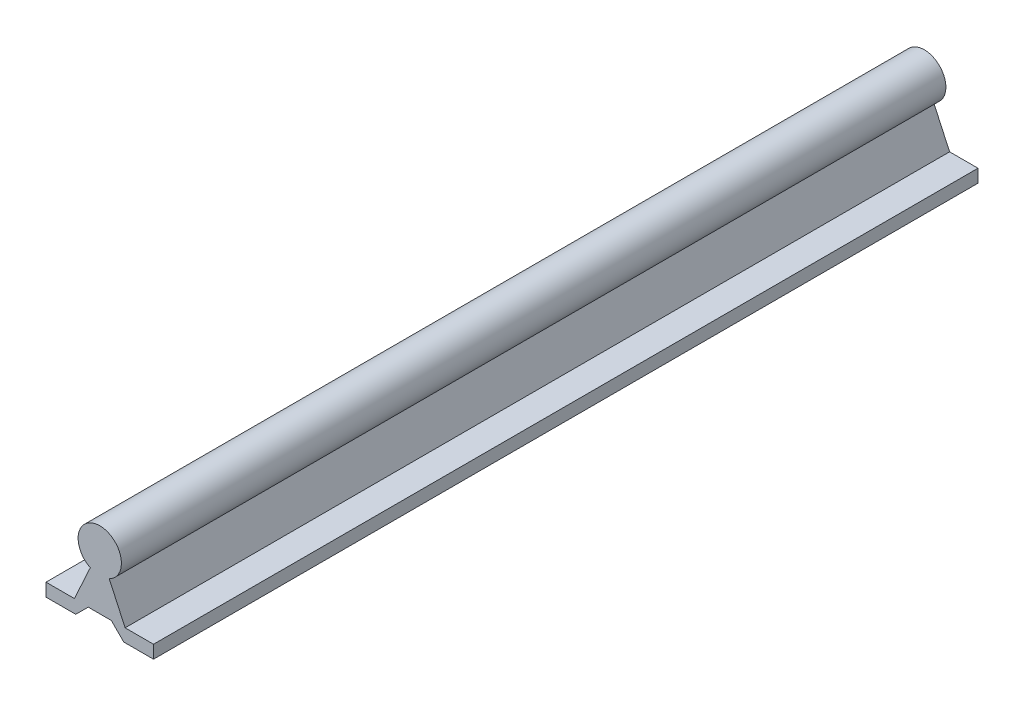
ISO-10303-21;
HEADER;
FILE_DESCRIPTION(('STEP AP214'),'2;1');
FILE_NAME('part.step','',(''),(''),'','','');
FILE_SCHEMA(('AUTOMOTIVE_DESIGN { 1 0 10303 214 1 1 1 1 }'));
ENDSEC;
DATA;
#1=APPLICATION_CONTEXT('core data for automotive mechanical design processes');
#2=APPLICATION_PROTOCOL_DEFINITION('international standard','automotive_design',2000,#1);
#3=PRODUCT_CONTEXT('',#1,'mechanical');
#4=PRODUCT('Part','Part','',(#3));
#5=PRODUCT_RELATED_PRODUCT_CATEGORY('part','',(#4));
#6=PRODUCT_DEFINITION_FORMATION('','',#4);
#7=PRODUCT_DEFINITION_CONTEXT('part definition',#1,'design');
#8=PRODUCT_DEFINITION('design','',#6,#7);
#9=PRODUCT_DEFINITION_SHAPE('','',#8);
#10=(LENGTH_UNIT() NAMED_UNIT(*) SI_UNIT(.MILLI.,.METRE.));
#11=(NAMED_UNIT(*) PLANE_ANGLE_UNIT() SI_UNIT($,.RADIAN.));
#12=(NAMED_UNIT(*) SI_UNIT($,.STERADIAN.) SOLID_ANGLE_UNIT());
#13=UNCERTAINTY_MEASURE_WITH_UNIT(LENGTH_MEASURE(1.E-05),#10,'distance_accuracy_value','');
#14=(GEOMETRIC_REPRESENTATION_CONTEXT(3) GLOBAL_UNCERTAINTY_ASSIGNED_CONTEXT((#13)) GLOBAL_UNIT_ASSIGNED_CONTEXT((#10,
#11,#12)) REPRESENTATION_CONTEXT('',''));
#15=CARTESIAN_POINT('',(0.,0.,0.));
#16=DIRECTION('',(0.,0.,1.));
#17=DIRECTION('',(1.,0.,0.));
#18=AXIS2_PLACEMENT_3D('',#15,#16,#17);
#19=CARTESIAN_POINT('',(9.5641655714519,4.38765921480913,304.8));
#20=DIRECTION('',(0.908917784747808,0.416975371657772,0.));
#21=DIRECTION('',(-0.416975371657772,0.908917784747808,0.));
#22=AXIS2_PLACEMENT_3D('',#19,#20,#21);
#23=PLANE('',#22);
#24=DIRECTION('',(0.416975371657772,-0.908917784747808,0.));
#25=VECTOR('',#24,1.);
#26=CARTESIAN_POINT('',(9.5641655714519,4.38765921480913,0.));
#27=LINE('',#26,#25);
#28=CARTESIAN_POINT('',(3.5,17.6062527150309,0.));
#29=VERTEX_POINT('',#28);
#30=CARTESIAN_POINT('',(9.375,4.79999999999999,0.));
#31=VERTEX_POINT('',#30);
#32=EDGE_CURVE('E156',#29,#31,#27,.T.);
#33=ORIENTED_EDGE('',*,*,#32,.F.);
#34=DIRECTION('',(0.,0.,-1.));
#35=VECTOR('',#34,1.);
#36=CARTESIAN_POINT('',(3.5,17.6062527150309,304.8));
#37=LINE('',#36,#35);
#38=CARTESIAN_POINT('',(3.5,17.6062527150309,304.8));
#39=VERTEX_POINT('',#38);
#40=EDGE_CURVE('E11',#39,#29,#37,.T.);
#41=ORIENTED_EDGE('',*,*,#40,.F.);
#42=DIRECTION('',(0.416975371657772,-0.908917784747808,0.));
#43=VECTOR('',#42,1.);
#44=CARTESIAN_POINT('',(9.5641655714519,4.38765921480913,304.8));
#45=LINE('',#44,#43);
#46=CARTESIAN_POINT('',(9.375,4.79999999999999,304.8));
#47=VERTEX_POINT('',#46);
#48=EDGE_CURVE('E182',#39,#47,#45,.T.);
#49=ORIENTED_EDGE('',*,*,#48,.T.);
#50=DIRECTION('',(0.,0.,-1.));
#51=VECTOR('',#50,1.);
#52=CARTESIAN_POINT('',(9.375,4.79999999999999,304.8));
#53=LINE('',#52,#51);
#54=EDGE_CURVE('E101',#47,#31,#53,.T.);
#55=ORIENTED_EDGE('',*,*,#54,.T.);
#56=EDGE_LOOP('',(#33,#41,#49,#55));
#57=FACE_BOUND('',#56,.T.);
#58=ADVANCED_FACE('F39',(#57),#23,.T.);
#59=CARTESIAN_POINT('',(0.,24.8,304.8));
#60=DIRECTION('',(0.,0.,-1.));
#61=DIRECTION('',(-1.,0.,0.));
#62=AXIS2_PLACEMENT_3D('',#59,#60,#61);
#63=CYLINDRICAL_SURFACE('',#62,8.);
#64=CARTESIAN_POINT('',(0.,24.8,0.));
#65=DIRECTION('',(0.,0.,1.));
#66=DIRECTION('',(1.,0.,0.));
#67=AXIS2_PLACEMENT_3D('',#64,#65,#66);
#68=CIRCLE('',#67,8.);
#69=CARTESIAN_POINT('',(-3.5,17.6062527150309,0.));
#70=VERTEX_POINT('',#69);
#71=EDGE_CURVE('E159',#29,#70,#68,.T.);
#72=ORIENTED_EDGE('',*,*,#71,.T.);
#73=DIRECTION('',(0.,0.,-1.));
#74=VECTOR('',#73,1.);
#75=CARTESIAN_POINT('',(-3.5,17.6062527150309,304.8));
#76=LINE('',#75,#74);
#77=CARTESIAN_POINT('',(-3.5,17.6062527150309,304.8));
#78=VERTEX_POINT('',#77);
#79=EDGE_CURVE('E47',#78,#70,#76,.T.);
#80=ORIENTED_EDGE('',*,*,#79,.F.);
#81=CARTESIAN_POINT('',(0.,24.8,304.8));
#82=DIRECTION('',(0.,0.,1.));
#83=DIRECTION('',(1.,0.,0.));
#84=AXIS2_PLACEMENT_3D('',#81,#82,#83);
#85=CIRCLE('',#84,8.);
#86=EDGE_CURVE('E243',#39,#78,#85,.T.);
#87=ORIENTED_EDGE('',*,*,#86,.F.);
#88=ORIENTED_EDGE('',*,*,#40,.T.);
#89=EDGE_LOOP('',(#72,#80,#87,#88));
#90=FACE_BOUND('',#89,.T.);
#91=ADVANCED_FACE('F246',(#90),#63,.T.);
#92=CARTESIAN_POINT('',(-9.5641655714519,4.38765921480913,304.8));
#93=DIRECTION('',(0.908917784747808,-0.416975371657772,0.));
#94=DIRECTION('',(0.416975371657772,0.908917784747808,0.));
#95=AXIS2_PLACEMENT_3D('',#92,#93,#94);
#96=PLANE('',#95);
#97=DIRECTION('',(-0.416975371657772,-0.908917784747808,0.));
#98=VECTOR('',#97,1.);
#99=CARTESIAN_POINT('',(-9.5641655714519,4.38765921480913,0.));
#100=LINE('',#99,#98);
#101=CARTESIAN_POINT('',(-9.375,4.79999999999999,0.));
#102=VERTEX_POINT('',#101);
#103=EDGE_CURVE('E161',#70,#102,#100,.T.);
#104=ORIENTED_EDGE('',*,*,#103,.T.);
#105=DIRECTION('',(0.,0.,-1.));
#106=VECTOR('',#105,1.);
#107=CARTESIAN_POINT('',(-9.375,4.79999999999999,304.8));
#108=LINE('',#107,#106);
#109=CARTESIAN_POINT('',(-9.375,4.79999999999999,304.8));
#110=VERTEX_POINT('',#109);
#111=EDGE_CURVE('E200',#110,#102,#108,.T.);
#112=ORIENTED_EDGE('',*,*,#111,.F.);
#113=DIRECTION('',(-0.416975371657772,-0.908917784747808,0.));
#114=VECTOR('',#113,1.);
#115=CARTESIAN_POINT('',(-9.5641655714519,4.38765921480913,304.8));
#116=LINE('',#115,#114);
#117=EDGE_CURVE('E209',#78,#110,#116,.T.);
#118=ORIENTED_EDGE('',*,*,#117,.F.);
#119=ORIENTED_EDGE('',*,*,#79,.T.);
#120=EDGE_LOOP('',(#104,#112,#118,#119));
#121=FACE_BOUND('',#120,.T.);
#122=ADVANCED_FACE('F207',(#121),#96,.F.);
#123=CARTESIAN_POINT('',(0.,4.79999999999999,304.8));
#124=DIRECTION('',(0.,-1.,0.));
#125=DIRECTION('',(1.,0.,0.));
#126=AXIS2_PLACEMENT_3D('',#123,#124,#125);
#127=PLANE('',#126);
#128=DIRECTION('',(-1.,0.,0.));
#129=VECTOR('',#128,1.);
#130=CARTESIAN_POINT('',(0.,4.79999999999999,0.));
#131=LINE('',#130,#129);
#132=CARTESIAN_POINT('',(-19.875,4.79999999999999,0.));
#133=VERTEX_POINT('',#132);
#134=EDGE_CURVE('E163',#102,#133,#131,.T.);
#135=ORIENTED_EDGE('',*,*,#134,.T.);
#136=DIRECTION('',(0.,0.,-1.));
#137=VECTOR('',#136,1.);
#138=CARTESIAN_POINT('',(-19.875,4.79999999999999,304.8));
#139=LINE('',#138,#137);
#140=CARTESIAN_POINT('',(-19.875,4.79999999999999,304.8));
#141=VERTEX_POINT('',#140);
#142=EDGE_CURVE('E197',#141,#133,#139,.T.);
#143=ORIENTED_EDGE('',*,*,#142,.F.);
#144=DIRECTION('',(-1.,0.,0.));
#145=VECTOR('',#144,1.);
#146=CARTESIAN_POINT('',(0.,4.79999999999999,304.8));
#147=LINE('',#146,#145);
#148=EDGE_CURVE('E228',#110,#141,#147,.T.);
#149=ORIENTED_EDGE('',*,*,#148,.F.);
#150=ORIENTED_EDGE('',*,*,#111,.T.);
#151=EDGE_LOOP('',(#135,#143,#149,#150));
#152=FACE_BOUND('',#151,.T.);
#153=ADVANCED_FACE('F219',(#152),#127,.F.);
#154=CARTESIAN_POINT('',(-19.875,0.,304.8));
#155=DIRECTION('',(1.,0.,0.));
#156=DIRECTION('',(0.,0.,-1.));
#157=AXIS2_PLACEMENT_3D('',#154,#155,#156);
#158=PLANE('',#157);
#159=DIRECTION('',(0.,-1.,0.));
#160=VECTOR('',#159,1.);
#161=CARTESIAN_POINT('',(-19.875,0.,0.));
#162=LINE('',#161,#160);
#163=CARTESIAN_POINT('',(-19.875,0.,0.));
#164=VERTEX_POINT('',#163);
#165=EDGE_CURVE('E165',#133,#164,#162,.T.);
#166=ORIENTED_EDGE('',*,*,#165,.T.);
#167=DIRECTION('',(0.,0.,-1.));
#168=VECTOR('',#167,1.);
#169=CARTESIAN_POINT('',(-19.875,0.,304.8));
#170=LINE('',#169,#168);
#171=CARTESIAN_POINT('',(-19.875,0.,304.8));
#172=VERTEX_POINT('',#171);
#173=EDGE_CURVE('E194',#172,#164,#170,.T.);
#174=ORIENTED_EDGE('',*,*,#173,.F.);
#175=DIRECTION('',(0.,-1.,0.));
#176=VECTOR('',#175,1.);
#177=CARTESIAN_POINT('',(-19.875,0.,304.8));
#178=LINE('',#177,#176);
#179=EDGE_CURVE('E225',#141,#172,#178,.T.);
#180=ORIENTED_EDGE('',*,*,#179,.F.);
#181=ORIENTED_EDGE('',*,*,#142,.T.);
#182=EDGE_LOOP('',(#166,#174,#180,#181));
#183=FACE_BOUND('',#182,.T.);
#184=ADVANCED_FACE('F223',(#183),#158,.F.);
#185=CARTESIAN_POINT('',(0.,0.,304.8));
#186=DIRECTION('',(0.,1.,0.));
#187=DIRECTION('',(-1.,0.,0.));
#188=AXIS2_PLACEMENT_3D('',#185,#186,#187);
#189=PLANE('',#188);
#190=DIRECTION('',(1.,0.,0.));
#191=VECTOR('',#190,1.);
#192=CARTESIAN_POINT('',(0.,0.,0.));
#193=LINE('',#192,#191);
#194=CARTESIAN_POINT('',(-8.875,0.,0.));
#195=VERTEX_POINT('',#194);
#196=EDGE_CURVE('E167',#164,#195,#193,.T.);
#197=ORIENTED_EDGE('',*,*,#196,.T.);
#198=DIRECTION('',(0.,0.,-1.));
#199=VECTOR('',#198,1.);
#200=CARTESIAN_POINT('',(-8.875,0.,304.8));
#201=LINE('',#200,#199);
#202=CARTESIAN_POINT('',(-8.875,0.,304.8));
#203=VERTEX_POINT('',#202);
#204=EDGE_CURVE('E191',#203,#195,#201,.T.);
#205=ORIENTED_EDGE('',*,*,#204,.F.);
#206=DIRECTION('',(1.,0.,0.));
#207=VECTOR('',#206,1.);
#208=CARTESIAN_POINT('',(0.,0.,304.8));
#209=LINE('',#208,#207);
#210=EDGE_CURVE('E227',#172,#203,#209,.T.);
#211=ORIENTED_EDGE('',*,*,#210,.F.);
#212=ORIENTED_EDGE('',*,*,#173,.T.);
#213=EDGE_LOOP('',(#197,#205,#211,#212));
#214=FACE_BOUND('',#213,.T.);
#215=ADVANCED_FACE('F258',(#214),#189,.F.);
#216=CARTESIAN_POINT('',(-4.43750000000002,4.4375,304.8));
#217=DIRECTION('',(-0.707106781186549,0.707106781186546,0.));
#218=DIRECTION('',(-0.707106781186546,-0.707106781186549,0.));
#219=AXIS2_PLACEMENT_3D('',#216,#217,#218);
#220=PLANE('',#219);
#221=DIRECTION('',(0.707106781186546,0.707106781186549,0.));
#222=VECTOR('',#221,1.);
#223=CARTESIAN_POINT('',(-4.43750000000002,4.4375,0.));
#224=LINE('',#223,#222);
#225=CARTESIAN_POINT('',(-4.27500000000002,4.59999999999999,0.));
#226=VERTEX_POINT('',#225);
#227=EDGE_CURVE('E169',#195,#226,#224,.T.);
#228=ORIENTED_EDGE('',*,*,#227,.T.);
#229=DIRECTION('',(0.,0.,-1.));
#230=VECTOR('',#229,1.);
#231=CARTESIAN_POINT('',(-4.27500000000002,4.59999999999999,304.8));
#232=LINE('',#231,#230);
#233=CARTESIAN_POINT('',(-4.27500000000002,4.59999999999999,304.8));
#234=VERTEX_POINT('',#233);
#235=EDGE_CURVE('E188',#234,#226,#232,.T.);
#236=ORIENTED_EDGE('',*,*,#235,.F.);
#237=DIRECTION('',(0.707106781186546,0.707106781186549,0.));
#238=VECTOR('',#237,1.);
#239=CARTESIAN_POINT('',(-4.43750000000002,4.4375,304.8));
#240=LINE('',#239,#238);
#241=EDGE_CURVE('E230',#203,#234,#240,.T.);
#242=ORIENTED_EDGE('',*,*,#241,.F.);
#243=ORIENTED_EDGE('',*,*,#204,.T.);
#244=EDGE_LOOP('',(#228,#236,#242,#243));
#245=FACE_BOUND('',#244,.T.);
#246=ADVANCED_FACE('F261',(#245),#220,.F.);
#247=CARTESIAN_POINT('',(0.,4.6,304.8));
#248=DIRECTION('',(0.,1.,0.));
#249=DIRECTION('',(-1.,0.,0.));
#250=AXIS2_PLACEMENT_3D('',#247,#248,#249);
#251=PLANE('',#250);
#252=DIRECTION('',(1.,0.,0.));
#253=VECTOR('',#252,1.);
#254=CARTESIAN_POINT('',(0.,4.6,0.));
#255=LINE('',#254,#253);
#256=CARTESIAN_POINT('',(4.27500000000002,4.6,0.));
#257=VERTEX_POINT('',#256);
#258=EDGE_CURVE('E171',#226,#257,#255,.T.);
#259=ORIENTED_EDGE('',*,*,#258,.T.);
#260=DIRECTION('',(0.,0.,-1.));
#261=VECTOR('',#260,1.);
#262=CARTESIAN_POINT('',(4.27500000000002,4.6,304.8));
#263=LINE('',#262,#261);
#264=CARTESIAN_POINT('',(4.27500000000002,4.6,304.8));
#265=VERTEX_POINT('',#264);
#266=EDGE_CURVE('E186',#265,#257,#263,.T.);
#267=ORIENTED_EDGE('',*,*,#266,.F.);
#268=DIRECTION('',(1.,0.,0.));
#269=VECTOR('',#268,1.);
#270=CARTESIAN_POINT('',(0.,4.6,304.8));
#271=LINE('',#270,#269);
#272=EDGE_CURVE('E236',#234,#265,#271,.T.);
#273=ORIENTED_EDGE('',*,*,#272,.F.);
#274=ORIENTED_EDGE('',*,*,#235,.T.);
#275=EDGE_LOOP('',(#259,#267,#273,#274));
#276=FACE_BOUND('',#275,.T.);
#277=ADVANCED_FACE('F265',(#276),#251,.F.);
#278=CARTESIAN_POINT('',(4.43750000000001,4.4375,304.8));
#279=DIRECTION('',(-0.707106781186549,-0.707106781186546,0.));
#280=DIRECTION('',(0.707106781186546,-0.707106781186549,0.));
#281=AXIS2_PLACEMENT_3D('',#278,#279,#280);
#282=PLANE('',#281);
#283=DIRECTION('',(-0.707106781186546,0.707106781186549,0.));
#284=VECTOR('',#283,1.);
#285=CARTESIAN_POINT('',(4.43750000000001,4.4375,0.));
#286=LINE('',#285,#284);
#287=CARTESIAN_POINT('',(8.875,0.,0.));
#288=VERTEX_POINT('',#287);
#289=EDGE_CURVE('E174',#288,#257,#286,.T.);
#290=ORIENTED_EDGE('',*,*,#289,.F.);
#291=DIRECTION('',(0.,0.,-1.));
#292=VECTOR('',#291,1.);
#293=CARTESIAN_POINT('',(8.875,0.,304.8));
#294=LINE('',#293,#292);
#295=CARTESIAN_POINT('',(8.875,0.,304.8));
#296=VERTEX_POINT('',#295);
#297=EDGE_CURVE('E143',#296,#288,#294,.T.);
#298=ORIENTED_EDGE('',*,*,#297,.F.);
#299=DIRECTION('',(-0.707106781186546,0.707106781186549,0.));
#300=VECTOR('',#299,1.);
#301=CARTESIAN_POINT('',(4.43750000000001,4.4375,304.8));
#302=LINE('',#301,#300);
#303=EDGE_CURVE('E149',#296,#265,#302,.T.);
#304=ORIENTED_EDGE('',*,*,#303,.T.);
#305=ORIENTED_EDGE('',*,*,#266,.T.);
#306=EDGE_LOOP('',(#290,#298,#304,#305));
#307=FACE_BOUND('',#306,.T.);
#308=ADVANCED_FACE('F239',(#307),#282,.T.);
#309=CARTESIAN_POINT('',(0.,0.,304.8));
#310=DIRECTION('',(0.,-1.,0.));
#311=DIRECTION('',(1.,0.,0.));
#312=AXIS2_PLACEMENT_3D('',#309,#310,#311);
#313=PLANE('',#312);
#314=DIRECTION('',(-1.,0.,0.));
#315=VECTOR('',#314,1.);
#316=CARTESIAN_POINT('',(0.,0.,0.));
#317=LINE('',#316,#315);
#318=CARTESIAN_POINT('',(19.875,0.,0.));
#319=VERTEX_POINT('',#318);
#320=EDGE_CURVE('E138',#319,#288,#317,.T.);
#321=ORIENTED_EDGE('',*,*,#320,.F.);
#322=DIRECTION('',(0.,0.,-1.));
#323=VECTOR('',#322,1.);
#324=CARTESIAN_POINT('',(19.875,0.,304.8));
#325=LINE('',#324,#323);
#326=CARTESIAN_POINT('',(19.875,0.,304.8));
#327=VERTEX_POINT('',#326);
#328=EDGE_CURVE('E133',#327,#319,#325,.T.);
#329=ORIENTED_EDGE('',*,*,#328,.F.);
#330=DIRECTION('',(-1.,0.,0.));
#331=VECTOR('',#330,1.);
#332=CARTESIAN_POINT('',(0.,0.,304.8));
#333=LINE('',#332,#331);
#334=EDGE_CURVE('E136',#327,#296,#333,.T.);
#335=ORIENTED_EDGE('',*,*,#334,.T.);
#336=ORIENTED_EDGE('',*,*,#297,.T.);
#337=EDGE_LOOP('',(#321,#329,#335,#336));
#338=FACE_BOUND('',#337,.T.);
#339=ADVANCED_FACE('F135',(#338),#313,.T.);
#340=CARTESIAN_POINT('',(19.875,0.,304.8));
#341=DIRECTION('',(1.,0.,0.));
#342=DIRECTION('',(0.,0.,-1.));
#343=AXIS2_PLACEMENT_3D('',#340,#341,#342);
#344=PLANE('',#343);
#345=DIRECTION('',(0.,-1.,0.));
#346=VECTOR('',#345,1.);
#347=CARTESIAN_POINT('',(19.875,0.,0.));
#348=LINE('',#347,#346);
#349=CARTESIAN_POINT('',(19.875,4.79999999999999,0.));
#350=VERTEX_POINT('',#349);
#351=EDGE_CURVE('E178',#350,#319,#348,.T.);
#352=ORIENTED_EDGE('',*,*,#351,.F.);
#353=DIRECTION('',(0.,0.,-1.));
#354=VECTOR('',#353,1.);
#355=CARTESIAN_POINT('',(19.875,4.79999999999999,304.8));
#356=LINE('',#355,#354);
#357=CARTESIAN_POINT('',(19.875,4.79999999999999,304.8));
#358=VERTEX_POINT('',#357);
#359=EDGE_CURVE('E94',#358,#350,#356,.T.);
#360=ORIENTED_EDGE('',*,*,#359,.F.);
#361=DIRECTION('',(0.,-1.,0.));
#362=VECTOR('',#361,1.);
#363=CARTESIAN_POINT('',(19.875,0.,304.8));
#364=LINE('',#363,#362);
#365=EDGE_CURVE('E147',#358,#327,#364,.T.);
#366=ORIENTED_EDGE('',*,*,#365,.T.);
#367=ORIENTED_EDGE('',*,*,#328,.T.);
#368=EDGE_LOOP('',(#352,#360,#366,#367));
#369=FACE_BOUND('',#368,.T.);
#370=ADVANCED_FACE('F151',(#369),#344,.T.);
#371=CARTESIAN_POINT('',(0.,4.79999999999999,304.8));
#372=DIRECTION('',(0.,-1.,0.));
#373=DIRECTION('',(1.,0.,0.));
#374=AXIS2_PLACEMENT_3D('',#371,#372,#373);
#375=PLANE('',#374);
#376=DIRECTION('',(-1.,0.,0.));
#377=VECTOR('',#376,1.);
#378=CARTESIAN_POINT('',(0.,4.79999999999999,0.));
#379=LINE('',#378,#377);
#380=EDGE_CURVE('E180',#350,#31,#379,.T.);
#381=ORIENTED_EDGE('',*,*,#380,.T.);
#382=ORIENTED_EDGE('',*,*,#54,.F.);
#383=DIRECTION('',(-1.,0.,0.));
#384=VECTOR('',#383,1.);
#385=CARTESIAN_POINT('',(0.,4.79999999999999,304.8));
#386=LINE('',#385,#384);
#387=EDGE_CURVE('E55',#358,#47,#386,.T.);
#388=ORIENTED_EDGE('',*,*,#387,.F.);
#389=ORIENTED_EDGE('',*,*,#359,.T.);
#390=EDGE_LOOP('',(#381,#382,#388,#389));
#391=FACE_BOUND('',#390,.T.);
#392=ADVANCED_FACE('F242',(#391),#375,.F.);
#393=CARTESIAN_POINT('',(0.,0.,304.8));
#394=DIRECTION('',(0.,0.,1.));
#395=DIRECTION('',(1.,0.,0.));
#396=AXIS2_PLACEMENT_3D('',#393,#394,#395);
#397=PLANE('',#396);
#398=ORIENTED_EDGE('',*,*,#48,.F.);
#399=ORIENTED_EDGE('',*,*,#86,.T.);
#400=ORIENTED_EDGE('',*,*,#117,.T.);
#401=ORIENTED_EDGE('',*,*,#148,.T.);
#402=ORIENTED_EDGE('',*,*,#179,.T.);
#403=ORIENTED_EDGE('',*,*,#210,.T.);
#404=ORIENTED_EDGE('',*,*,#241,.T.);
#405=ORIENTED_EDGE('',*,*,#272,.T.);
#406=ORIENTED_EDGE('',*,*,#303,.F.);
#407=ORIENTED_EDGE('',*,*,#334,.F.);
#408=ORIENTED_EDGE('',*,*,#365,.F.);
#409=ORIENTED_EDGE('',*,*,#387,.T.);
#410=EDGE_LOOP('',(#398,#399,#400,#401,#402,#403,#404,#405,#406,#407,#408,#409));
#411=FACE_BOUND('',#410,.T.);
#412=ADVANCED_FACE('F146',(#411),#397,.T.);
#413=CARTESIAN_POINT('',(0.,0.,0.));
#414=DIRECTION('',(0.,0.,1.));
#415=DIRECTION('',(1.,0.,0.));
#416=AXIS2_PLACEMENT_3D('',#413,#414,#415);
#417=PLANE('',#416);
#418=ORIENTED_EDGE('',*,*,#32,.T.);
#419=ORIENTED_EDGE('',*,*,#380,.F.);
#420=ORIENTED_EDGE('',*,*,#351,.T.);
#421=ORIENTED_EDGE('',*,*,#320,.T.);
#422=ORIENTED_EDGE('',*,*,#289,.T.);
#423=ORIENTED_EDGE('',*,*,#258,.F.);
#424=ORIENTED_EDGE('',*,*,#227,.F.);
#425=ORIENTED_EDGE('',*,*,#196,.F.);
#426=ORIENTED_EDGE('',*,*,#165,.F.);
#427=ORIENTED_EDGE('',*,*,#134,.F.);
#428=ORIENTED_EDGE('',*,*,#103,.F.);
#429=ORIENTED_EDGE('',*,*,#71,.F.);
#430=EDGE_LOOP('',(#418,#419,#420,#421,#422,#423,#424,#425,#426,#427,#428,#429));
#431=FACE_BOUND('',#430,.T.);
#432=ADVANCED_FACE('F214',(#431),#417,.F.);
#433=CLOSED_SHELL('',(#58,#91,#122,#153,#184,#215,#246,#277,#308,#339,#370,#392,#412,#432));
#434=MANIFOLD_SOLID_BREP('B2',#433);
#435=ADVANCED_BREP_SHAPE_REPRESENTATION('',(#18,#434),#14);
#436=SHAPE_DEFINITION_REPRESENTATION(#9,#435);
ENDSEC;
END-ISO-10303-21;
